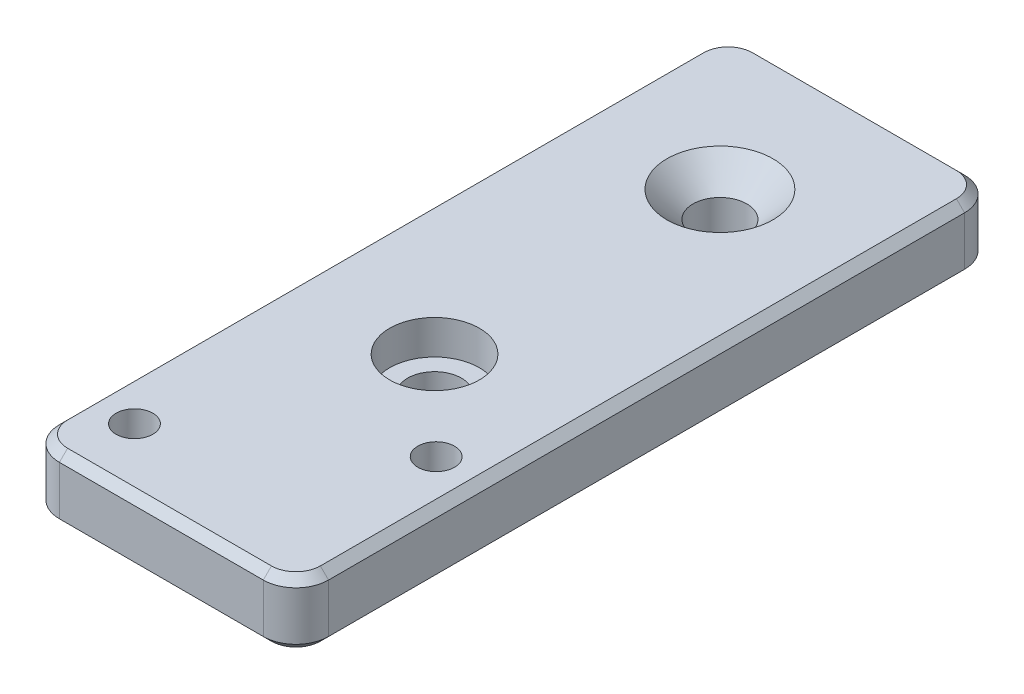
ISO-10303-21;
HEADER;
FILE_DESCRIPTION(('STEP AP214'),'2;1');
FILE_NAME('part.step','',(''),(''),'','','');
FILE_SCHEMA(('AUTOMOTIVE_DESIGN { 1 0 10303 214 1 1 1 1 }'));
ENDSEC;
DATA;
#1=APPLICATION_CONTEXT('core data for automotive mechanical design processes');
#2=APPLICATION_PROTOCOL_DEFINITION('international standard','automotive_design',2000,#1);
#3=PRODUCT_CONTEXT('',#1,'mechanical');
#4=PRODUCT('Part','Part','',(#3));
#5=PRODUCT_RELATED_PRODUCT_CATEGORY('part','',(#4));
#6=PRODUCT_DEFINITION_FORMATION('','',#4);
#7=PRODUCT_DEFINITION_CONTEXT('part definition',#1,'design');
#8=PRODUCT_DEFINITION('design','',#6,#7);
#9=PRODUCT_DEFINITION_SHAPE('','',#8);
#10=(LENGTH_UNIT() NAMED_UNIT(*) SI_UNIT(.MILLI.,.METRE.));
#11=(NAMED_UNIT(*) PLANE_ANGLE_UNIT() SI_UNIT($,.RADIAN.));
#12=(NAMED_UNIT(*) SI_UNIT($,.STERADIAN.) SOLID_ANGLE_UNIT());
#13=UNCERTAINTY_MEASURE_WITH_UNIT(LENGTH_MEASURE(1.E-05),#10,'distance_accuracy_value','');
#14=(GEOMETRIC_REPRESENTATION_CONTEXT(3) GLOBAL_UNCERTAINTY_ASSIGNED_CONTEXT((#13)) GLOBAL_UNIT_ASSIGNED_CONTEXT((#10,
#11,#12)) REPRESENTATION_CONTEXT('',''));
#15=CARTESIAN_POINT('',(0.,0.,0.));
#16=DIRECTION('',(0.,0.,1.));
#17=DIRECTION('',(1.,0.,0.));
#18=AXIS2_PLACEMENT_3D('',#15,#16,#17);
#19=CARTESIAN_POINT('',(-11.,0.,35.3));
#20=DIRECTION('',(0.,1.,0.));
#21=DIRECTION('',(0.,0.,1.));
#22=AXIS2_PLACEMENT_3D('',#19,#20,#21);
#23=CYLINDRICAL_SURFACE('',#22,2.25);
#24=CARTESIAN_POINT('',(-11.,8.,35.3));
#25=DIRECTION('',(0.,1.,0.));
#26=DIRECTION('',(0.,0.,1.));
#27=AXIS2_PLACEMENT_3D('',#24,#25,#26);
#28=CIRCLE('',#27,2.25);
#29=CARTESIAN_POINT('',(-11.,8.,37.55));
#30=VERTEX_POINT('',#29);
#31=EDGE_CURVE('E320',#30,#30,#28,.T.);
#32=ORIENTED_EDGE('',*,*,#31,.T.);
#33=EDGE_LOOP('',(#32));
#34=FACE_BOUND('',#33,.T.);
#35=CARTESIAN_POINT('',(-11.,4.4,35.3));
#36=DIRECTION('',(0.,-1.,0.));
#37=DIRECTION('',(0.,0.,-1.));
#38=AXIS2_PLACEMENT_3D('',#35,#36,#37);
#39=CIRCLE('',#38,2.25);
#40=CARTESIAN_POINT('',(-11.,4.4,33.05));
#41=VERTEX_POINT('',#40);
#42=EDGE_CURVE('E40',#41,#41,#39,.F.);
#43=ORIENTED_EDGE('',*,*,#42,.F.);
#44=EDGE_LOOP('',(#43));
#45=FACE_BOUND('',#44,.T.);
#46=ADVANCED_FACE('F36',(#34,#45),#23,.F.);
#47=CARTESIAN_POINT('',(11.,0.,20.3));
#48=DIRECTION('',(0.,1.,0.));
#49=DIRECTION('',(0.,0.,1.));
#50=AXIS2_PLACEMENT_3D('',#47,#48,#49);
#51=CYLINDRICAL_SURFACE('',#50,2.25);
#52=CARTESIAN_POINT('',(11.,8.,20.3));
#53=DIRECTION('',(0.,1.,0.));
#54=DIRECTION('',(0.,0.,1.));
#55=AXIS2_PLACEMENT_3D('',#52,#53,#54);
#56=CIRCLE('',#55,2.25);
#57=CARTESIAN_POINT('',(11.,8.,22.55));
#58=VERTEX_POINT('',#57);
#59=EDGE_CURVE('E366',#58,#58,#56,.T.);
#60=ORIENTED_EDGE('',*,*,#59,.T.);
#61=EDGE_LOOP('',(#60));
#62=FACE_BOUND('',#61,.T.);
#63=CARTESIAN_POINT('',(11.,4.4,20.3));
#64=DIRECTION('',(0.,-1.,0.));
#65=DIRECTION('',(0.,0.,-1.));
#66=AXIS2_PLACEMENT_3D('',#63,#64,#65);
#67=CIRCLE('',#66,2.25);
#68=CARTESIAN_POINT('',(11.,4.4,18.05));
#69=VERTEX_POINT('',#68);
#70=EDGE_CURVE('E324',#69,#69,#67,.F.);
#71=ORIENTED_EDGE('',*,*,#70,.F.);
#72=EDGE_LOOP('',(#71));
#73=FACE_BOUND('',#72,.T.);
#74=ADVANCED_FACE('F480',(#62,#73),#51,.F.);
#75=CARTESIAN_POINT('',(0.,0.,9.50000000000002));
#76=DIRECTION('',(0.,1.,0.));
#77=DIRECTION('',(0.,0.,1.));
#78=AXIS2_PLACEMENT_3D('',#75,#76,#77);
#79=CYLINDRICAL_SURFACE('',#78,3.3);
#80=CARTESIAN_POINT('',(0.,0.,9.50000000000002));
#81=DIRECTION('',(0.,1.,0.));
#82=DIRECTION('',(0.,0.,1.));
#83=AXIS2_PLACEMENT_3D('',#80,#81,#82);
#84=CIRCLE('',#83,3.3);
#85=CARTESIAN_POINT('',(0.,0.,12.8));
#86=VERTEX_POINT('',#85);
#87=EDGE_CURVE('E362',#86,#86,#84,.T.);
#88=ORIENTED_EDGE('',*,*,#87,.F.);
#89=EDGE_LOOP('',(#88));
#90=FACE_BOUND('',#89,.T.);
#91=CARTESIAN_POINT('',(0.,3.8,9.50000000000002));
#92=DIRECTION('',(0.,1.,0.));
#93=DIRECTION('',(0.,0.,1.));
#94=AXIS2_PLACEMENT_3D('',#91,#92,#93);
#95=CIRCLE('',#94,3.3);
#96=CARTESIAN_POINT('',(0.,3.8,12.8));
#97=VERTEX_POINT('',#96);
#98=EDGE_CURVE('E316',#97,#97,#95,.F.);
#99=ORIENTED_EDGE('',*,*,#98,.F.);
#100=EDGE_LOOP('',(#99));
#101=FACE_BOUND('',#100,.T.);
#102=ADVANCED_FACE('F486',(#90,#101),#79,.F.);
#103=CARTESIAN_POINT('',(16.5,8.,-43.));
#104=DIRECTION('',(-1.,0.,0.));
#105=DIRECTION('',(0.,0.,1.));
#106=AXIS2_PLACEMENT_3D('',#103,#104,#105);
#107=PLANE('',#106);
#108=DIRECTION('',(0.,-1.,0.));
#109=VECTOR('',#108,1.);
#110=CARTESIAN_POINT('',(16.5,8.,-39.));
#111=LINE('',#110,#109);
#112=CARTESIAN_POINT('',(16.5,0.999999999999987,-39.));
#113=VERTEX_POINT('',#112);
#114=CARTESIAN_POINT('',(16.5,6.99999999999999,-39.));
#115=VERTEX_POINT('',#114);
#116=EDGE_CURVE('E392',#113,#115,#111,.F.);
#117=ORIENTED_EDGE('',*,*,#116,.T.);
#118=DIRECTION('',(0.,0.,1.));
#119=VECTOR('',#118,1.);
#120=CARTESIAN_POINT('',(16.5,6.99999999999999,39.));
#121=LINE('',#120,#119);
#122=CARTESIAN_POINT('',(16.5,6.99999999999999,39.));
#123=VERTEX_POINT('',#122);
#124=EDGE_CURVE('E161',#115,#123,#121,.T.);
#125=ORIENTED_EDGE('',*,*,#124,.T.);
#126=DIRECTION('',(0.,-1.,0.));
#127=VECTOR('',#126,1.);
#128=CARTESIAN_POINT('',(16.5,8.,39.));
#129=LINE('',#128,#127);
#130=CARTESIAN_POINT('',(16.5,0.999999999999987,39.));
#131=VERTEX_POINT('',#130);
#132=EDGE_CURVE('E388',#123,#131,#129,.T.);
#133=ORIENTED_EDGE('',*,*,#132,.T.);
#134=DIRECTION('',(0.,0.,-1.));
#135=VECTOR('',#134,1.);
#136=CARTESIAN_POINT('',(16.5,0.999999999999987,-43.));
#137=LINE('',#136,#135);
#138=EDGE_CURVE('E184',#131,#113,#137,.T.);
#139=ORIENTED_EDGE('',*,*,#138,.T.);
#140=EDGE_LOOP('',(#117,#125,#133,#139));
#141=FACE_BOUND('',#140,.T.);
#142=ADVANCED_FACE('F429',(#141),#107,.F.);
#143=CARTESIAN_POINT('',(-16.5,8.,-43.));
#144=DIRECTION('',(0.,0.,1.));
#145=DIRECTION('',(1.,0.,0.));
#146=AXIS2_PLACEMENT_3D('',#143,#144,#145);
#147=PLANE('',#146);
#148=DIRECTION('',(0.,-1.,0.));
#149=VECTOR('',#148,1.);
#150=CARTESIAN_POINT('',(-12.5,8.,-43.));
#151=LINE('',#150,#149);
#152=CARTESIAN_POINT('',(-12.5,0.999999999999987,-43.));
#153=VERTEX_POINT('',#152);
#154=CARTESIAN_POINT('',(-12.5,6.99999999999999,-43.));
#155=VERTEX_POINT('',#154);
#156=EDGE_CURVE('E384',#153,#155,#151,.F.);
#157=ORIENTED_EDGE('',*,*,#156,.T.);
#158=DIRECTION('',(1.,0.,0.));
#159=VECTOR('',#158,1.);
#160=CARTESIAN_POINT('',(12.5,6.99999999999999,-43.));
#161=LINE('',#160,#159);
#162=CARTESIAN_POINT('',(12.5,6.99999999999999,-43.));
#163=VERTEX_POINT('',#162);
#164=EDGE_CURVE('E230',#155,#163,#161,.T.);
#165=ORIENTED_EDGE('',*,*,#164,.T.);
#166=DIRECTION('',(0.,-1.,0.));
#167=VECTOR('',#166,1.);
#168=CARTESIAN_POINT('',(12.5,8.,-43.));
#169=LINE('',#168,#167);
#170=CARTESIAN_POINT('',(12.5,0.999999999999987,-43.));
#171=VERTEX_POINT('',#170);
#172=EDGE_CURVE('E380',#163,#171,#169,.T.);
#173=ORIENTED_EDGE('',*,*,#172,.T.);
#174=DIRECTION('',(-1.,0.,0.));
#175=VECTOR('',#174,1.);
#176=CARTESIAN_POINT('',(-16.5,0.999999999999987,-43.));
#177=LINE('',#176,#175);
#178=EDGE_CURVE('E227',#171,#153,#177,.T.);
#179=ORIENTED_EDGE('',*,*,#178,.T.);
#180=EDGE_LOOP('',(#157,#165,#173,#179));
#181=FACE_BOUND('',#180,.T.);
#182=ADVANCED_FACE('F503',(#181),#147,.F.);
#183=CARTESIAN_POINT('',(-16.5,8.,-43.));
#184=DIRECTION('',(1.,0.,0.));
#185=DIRECTION('',(0.,0.,-1.));
#186=AXIS2_PLACEMENT_3D('',#183,#184,#185);
#187=PLANE('',#186);
#188=DIRECTION('',(0.,-1.,0.));
#189=VECTOR('',#188,1.);
#190=CARTESIAN_POINT('',(-16.5,8.,39.));
#191=LINE('',#190,#189);
#192=CARTESIAN_POINT('',(-16.5,0.999999999999987,39.));
#193=VERTEX_POINT('',#192);
#194=CARTESIAN_POINT('',(-16.5,6.99999999999999,39.));
#195=VERTEX_POINT('',#194);
#196=EDGE_CURVE('E286',#193,#195,#191,.F.);
#197=ORIENTED_EDGE('',*,*,#196,.T.);
#198=DIRECTION('',(0.,0.,-1.));
#199=VECTOR('',#198,1.);
#200=CARTESIAN_POINT('',(-16.5,6.99999999999999,-39.));
#201=LINE('',#200,#199);
#202=CARTESIAN_POINT('',(-16.5,6.99999999999999,-39.));
#203=VERTEX_POINT('',#202);
#204=EDGE_CURVE('E218',#195,#203,#201,.T.);
#205=ORIENTED_EDGE('',*,*,#204,.T.);
#206=DIRECTION('',(0.,-1.,0.));
#207=VECTOR('',#206,1.);
#208=CARTESIAN_POINT('',(-16.5,8.,-39.));
#209=LINE('',#208,#207);
#210=CARTESIAN_POINT('',(-16.5,0.999999999999987,-39.));
#211=VERTEX_POINT('',#210);
#212=EDGE_CURVE('E376',#203,#211,#209,.T.);
#213=ORIENTED_EDGE('',*,*,#212,.T.);
#214=DIRECTION('',(0.,0.,1.));
#215=VECTOR('',#214,1.);
#216=CARTESIAN_POINT('',(-16.5,0.999999999999987,-43.));
#217=LINE('',#216,#215);
#218=EDGE_CURVE('E215',#211,#193,#217,.T.);
#219=ORIENTED_EDGE('',*,*,#218,.T.);
#220=EDGE_LOOP('',(#197,#205,#213,#219));
#221=FACE_BOUND('',#220,.T.);
#222=ADVANCED_FACE('F459',(#221),#187,.F.);
#223=CARTESIAN_POINT('',(-16.5,8.,43.));
#224=DIRECTION('',(0.,0.,-1.));
#225=DIRECTION('',(-1.,0.,0.));
#226=AXIS2_PLACEMENT_3D('',#223,#224,#225);
#227=PLANE('',#226);
#228=DIRECTION('',(0.,-1.,0.));
#229=VECTOR('',#228,1.);
#230=CARTESIAN_POINT('',(12.5,8.,43.));
#231=LINE('',#230,#229);
#232=CARTESIAN_POINT('',(12.5,0.999999999999987,43.));
#233=VERTEX_POINT('',#232);
#234=CARTESIAN_POINT('',(12.5,6.99999999999999,43.));
#235=VERTEX_POINT('',#234);
#236=EDGE_CURVE('E396',#233,#235,#231,.F.);
#237=ORIENTED_EDGE('',*,*,#236,.T.);
#238=DIRECTION('',(-1.,0.,0.));
#239=VECTOR('',#238,1.);
#240=CARTESIAN_POINT('',(-12.5,6.99999999999999,43.));
#241=LINE('',#240,#239);
#242=CARTESIAN_POINT('',(-12.5,6.99999999999999,43.));
#243=VERTEX_POINT('',#242);
#244=EDGE_CURVE('E206',#235,#243,#241,.T.);
#245=ORIENTED_EDGE('',*,*,#244,.T.);
#246=DIRECTION('',(0.,-1.,0.));
#247=VECTOR('',#246,1.);
#248=CARTESIAN_POINT('',(-12.5,8.,43.));
#249=LINE('',#248,#247);
#250=CARTESIAN_POINT('',(-12.5,0.999999999999987,43.));
#251=VERTEX_POINT('',#250);
#252=EDGE_CURVE('E177',#243,#251,#249,.T.);
#253=ORIENTED_EDGE('',*,*,#252,.T.);
#254=DIRECTION('',(1.,0.,0.));
#255=VECTOR('',#254,1.);
#256=CARTESIAN_POINT('',(-16.5,0.999999999999987,43.));
#257=LINE('',#256,#255);
#258=EDGE_CURVE('E202',#251,#233,#257,.T.);
#259=ORIENTED_EDGE('',*,*,#258,.T.);
#260=EDGE_LOOP('',(#237,#245,#253,#259));
#261=FACE_BOUND('',#260,.T.);
#262=ADVANCED_FACE('F439',(#261),#227,.F.);
#263=CARTESIAN_POINT('',(0.,8.,0.));
#264=DIRECTION('',(0.,1.,0.));
#265=DIRECTION('',(0.,0.,1.));
#266=AXIS2_PLACEMENT_3D('',#263,#264,#265);
#267=PLANE('',#266);
#268=CARTESIAN_POINT('',(0.,8.,-25.5));
#269=DIRECTION('',(0.,1.,0.));
#270=DIRECTION('',(0.,0.,1.));
#271=AXIS2_PLACEMENT_3D('',#268,#269,#270);
#272=CIRCLE('',#271,6.49999999999998);
#273=CARTESIAN_POINT('',(0.,8.,-19.));
#274=VERTEX_POINT('',#273);
#275=EDGE_CURVE('E11',#274,#274,#272,.F.);
#276=ORIENTED_EDGE('',*,*,#275,.T.);
#277=EDGE_LOOP('',(#276));
#278=FACE_BOUND('',#277,.T.);
#279=CARTESIAN_POINT('',(0.,8.,9.50000000000002));
#280=DIRECTION('',(0.,1.,0.));
#281=DIRECTION('',(0.,0.,1.));
#282=AXIS2_PLACEMENT_3D('',#279,#280,#281);
#283=CIRCLE('',#282,5.5);
#284=CARTESIAN_POINT('',(0.,8.,15.));
#285=VERTEX_POINT('',#284);
#286=EDGE_CURVE('E334',#285,#285,#283,.T.);
#287=ORIENTED_EDGE('',*,*,#286,.F.);
#288=EDGE_LOOP('',(#287));
#289=FACE_BOUND('',#288,.T.);
#290=ORIENTED_EDGE('',*,*,#59,.F.);
#291=EDGE_LOOP('',(#290));
#292=FACE_BOUND('',#291,.T.);
#293=ORIENTED_EDGE('',*,*,#31,.F.);
#294=EDGE_LOOP('',(#293));
#295=FACE_BOUND('',#294,.T.);
#296=CARTESIAN_POINT('',(12.5,8.,39.));
#297=DIRECTION('',(0.,1.,0.));
#298=DIRECTION('',(0.,0.,1.));
#299=AXIS2_PLACEMENT_3D('',#296,#297,#298);
#300=CIRCLE('',#299,2.99999999999999);
#301=CARTESIAN_POINT('',(12.5,8.,42.));
#302=VERTEX_POINT('',#301);
#303=CARTESIAN_POINT('',(15.5,8.,39.));
#304=VERTEX_POINT('',#303);
#305=EDGE_CURVE('E181',#302,#304,#300,.T.);
#306=ORIENTED_EDGE('',*,*,#305,.T.);
#307=DIRECTION('',(0.,0.,-1.));
#308=VECTOR('',#307,1.);
#309=CARTESIAN_POINT('',(15.5,8.,-39.));
#310=LINE('',#309,#308);
#311=CARTESIAN_POINT('',(15.5,8.,-39.));
#312=VERTEX_POINT('',#311);
#313=EDGE_CURVE('E159',#304,#312,#310,.T.);
#314=ORIENTED_EDGE('',*,*,#313,.T.);
#315=CARTESIAN_POINT('',(12.5,8.,-39.));
#316=DIRECTION('',(0.,1.,0.));
#317=DIRECTION('',(0.,0.,1.));
#318=AXIS2_PLACEMENT_3D('',#315,#316,#317);
#319=CIRCLE('',#318,2.99999999999999);
#320=CARTESIAN_POINT('',(12.5,8.,-42.));
#321=VERTEX_POINT('',#320);
#322=EDGE_CURVE('E169',#312,#321,#319,.T.);
#323=ORIENTED_EDGE('',*,*,#322,.T.);
#324=DIRECTION('',(-1.,0.,0.));
#325=VECTOR('',#324,1.);
#326=CARTESIAN_POINT('',(-12.5,8.,-42.));
#327=LINE('',#326,#325);
#328=CARTESIAN_POINT('',(-12.5,8.,-42.));
#329=VERTEX_POINT('',#328);
#330=EDGE_CURVE('E176',#321,#329,#327,.T.);
#331=ORIENTED_EDGE('',*,*,#330,.T.);
#332=CARTESIAN_POINT('',(-12.5,8.,-39.));
#333=DIRECTION('',(0.,1.,0.));
#334=DIRECTION('',(0.,0.,1.));
#335=AXIS2_PLACEMENT_3D('',#332,#333,#334);
#336=CIRCLE('',#335,2.99999999999999);
#337=CARTESIAN_POINT('',(-15.5,8.,-39.));
#338=VERTEX_POINT('',#337);
#339=EDGE_CURVE('E405',#329,#338,#336,.T.);
#340=ORIENTED_EDGE('',*,*,#339,.T.);
#341=DIRECTION('',(0.,0.,1.));
#342=VECTOR('',#341,1.);
#343=CARTESIAN_POINT('',(-15.5,8.,39.));
#344=LINE('',#343,#342);
#345=CARTESIAN_POINT('',(-15.5,8.,39.));
#346=VERTEX_POINT('',#345);
#347=EDGE_CURVE('E408',#338,#346,#344,.T.);
#348=ORIENTED_EDGE('',*,*,#347,.T.);
#349=CARTESIAN_POINT('',(-12.5,8.,39.));
#350=DIRECTION('',(0.,1.,0.));
#351=DIRECTION('',(0.,0.,1.));
#352=AXIS2_PLACEMENT_3D('',#349,#350,#351);
#353=CIRCLE('',#352,2.99999999999999);
#354=CARTESIAN_POINT('',(-12.5,8.,42.));
#355=VERTEX_POINT('',#354);
#356=EDGE_CURVE('E411',#346,#355,#353,.T.);
#357=ORIENTED_EDGE('',*,*,#356,.T.);
#358=DIRECTION('',(1.,0.,0.));
#359=VECTOR('',#358,1.);
#360=CARTESIAN_POINT('',(12.5,8.,42.));
#361=LINE('',#360,#359);
#362=EDGE_CURVE('E190',#355,#302,#361,.T.);
#363=ORIENTED_EDGE('',*,*,#362,.T.);
#364=EDGE_LOOP('',(#306,#314,#323,#331,#340,#348,#357,#363));
#365=FACE_BOUND('',#364,.T.);
#366=ADVANCED_FACE('F179',(#278,#289,#292,#295,#365),#267,.T.);
#367=CARTESIAN_POINT('',(0.,0.,0.));
#368=DIRECTION('',(0.,1.,0.));
#369=DIRECTION('',(0.,0.,1.));
#370=AXIS2_PLACEMENT_3D('',#367,#368,#369);
#371=PLANE('',#370);
#372=CARTESIAN_POINT('',(11.,0.,20.3));
#373=DIRECTION('',(0.,-1.,0.));
#374=DIRECTION('',(0.,0.,-1.));
#375=AXIS2_PLACEMENT_3D('',#372,#373,#374);
#376=CIRCLE('',#375,4.);
#377=CARTESIAN_POINT('',(11.,0.,16.3));
#378=VERTEX_POINT('',#377);
#379=EDGE_CURVE('E336',#378,#378,#376,.T.);
#380=ORIENTED_EDGE('',*,*,#379,.F.);
#381=EDGE_LOOP('',(#380));
#382=FACE_BOUND('',#381,.T.);
#383=CARTESIAN_POINT('',(-11.,0.,35.3));
#384=DIRECTION('',(0.,-1.,0.));
#385=DIRECTION('',(0.,0.,-1.));
#386=AXIS2_PLACEMENT_3D('',#383,#384,#385);
#387=CIRCLE('',#386,4.);
#388=CARTESIAN_POINT('',(-11.,0.,31.3));
#389=VERTEX_POINT('',#388);
#390=EDGE_CURVE('E349',#389,#389,#387,.T.);
#391=ORIENTED_EDGE('',*,*,#390,.F.);
#392=EDGE_LOOP('',(#391));
#393=FACE_BOUND('',#392,.T.);
#394=CARTESIAN_POINT('',(0.,0.,-25.5));
#395=DIRECTION('',(0.,1.,0.));
#396=DIRECTION('',(0.,0.,1.));
#397=AXIS2_PLACEMENT_3D('',#394,#395,#396);
#398=CIRCLE('',#397,3.3);
#399=CARTESIAN_POINT('',(0.,0.,-22.2));
#400=VERTEX_POINT('',#399);
#401=EDGE_CURVE('E290',#400,#400,#398,.T.);
#402=ORIENTED_EDGE('',*,*,#401,.T.);
#403=EDGE_LOOP('',(#402));
#404=FACE_BOUND('',#403,.T.);
#405=ORIENTED_EDGE('',*,*,#87,.T.);
#406=EDGE_LOOP('',(#405));
#407=FACE_BOUND('',#406,.T.);
#408=CARTESIAN_POINT('',(12.5,0.,39.));
#409=DIRECTION('',(0.,1.,0.));
#410=DIRECTION('',(0.,0.,1.));
#411=AXIS2_PLACEMENT_3D('',#408,#409,#410);
#412=CIRCLE('',#411,3.);
#413=CARTESIAN_POINT('',(15.5,0.,39.));
#414=VERTEX_POINT('',#413);
#415=CARTESIAN_POINT('',(12.5,0.,42.));
#416=VERTEX_POINT('',#415);
#417=EDGE_CURVE('E62',#414,#416,#412,.F.);
#418=ORIENTED_EDGE('',*,*,#417,.T.);
#419=DIRECTION('',(-1.,0.,0.));
#420=VECTOR('',#419,1.);
#421=CARTESIAN_POINT('',(0.,0.,42.));
#422=LINE('',#421,#420);
#423=CARTESIAN_POINT('',(-12.5,0.,42.));
#424=VERTEX_POINT('',#423);
#425=EDGE_CURVE('E259',#416,#424,#422,.T.);
#426=ORIENTED_EDGE('',*,*,#425,.T.);
#427=CARTESIAN_POINT('',(-12.5,0.,39.));
#428=DIRECTION('',(0.,1.,0.));
#429=DIRECTION('',(0.,0.,1.));
#430=AXIS2_PLACEMENT_3D('',#427,#428,#429);
#431=CIRCLE('',#430,3.);
#432=CARTESIAN_POINT('',(-15.5,0.,39.));
#433=VERTEX_POINT('',#432);
#434=EDGE_CURVE('E256',#424,#433,#431,.F.);
#435=ORIENTED_EDGE('',*,*,#434,.T.);
#436=DIRECTION('',(0.,0.,-1.));
#437=VECTOR('',#436,1.);
#438=CARTESIAN_POINT('',(-15.5,0.,0.));
#439=LINE('',#438,#437);
#440=CARTESIAN_POINT('',(-15.5,0.,-39.));
#441=VERTEX_POINT('',#440);
#442=EDGE_CURVE('E245',#433,#441,#439,.T.);
#443=ORIENTED_EDGE('',*,*,#442,.T.);
#444=CARTESIAN_POINT('',(-12.5,0.,-39.));
#445=DIRECTION('',(0.,1.,0.));
#446=DIRECTION('',(0.,0.,1.));
#447=AXIS2_PLACEMENT_3D('',#444,#445,#446);
#448=CIRCLE('',#447,3.);
#449=CARTESIAN_POINT('',(-12.5,0.,-42.));
#450=VERTEX_POINT('',#449);
#451=EDGE_CURVE('E242',#441,#450,#448,.F.);
#452=ORIENTED_EDGE('',*,*,#451,.T.);
#453=DIRECTION('',(1.,0.,0.));
#454=VECTOR('',#453,1.);
#455=CARTESIAN_POINT('',(0.,0.,-42.));
#456=LINE('',#455,#454);
#457=CARTESIAN_POINT('',(12.5,0.,-42.));
#458=VERTEX_POINT('',#457);
#459=EDGE_CURVE('E239',#450,#458,#456,.T.);
#460=ORIENTED_EDGE('',*,*,#459,.T.);
#461=CARTESIAN_POINT('',(12.5,0.,-39.));
#462=DIRECTION('',(0.,1.,0.));
#463=DIRECTION('',(0.,0.,1.));
#464=AXIS2_PLACEMENT_3D('',#461,#462,#463);
#465=CIRCLE('',#464,3.);
#466=CARTESIAN_POINT('',(15.5,0.,-39.));
#467=VERTEX_POINT('',#466);
#468=EDGE_CURVE('E248',#458,#467,#465,.F.);
#469=ORIENTED_EDGE('',*,*,#468,.T.);
#470=DIRECTION('',(0.,0.,1.));
#471=VECTOR('',#470,1.);
#472=CARTESIAN_POINT('',(15.5,0.,0.));
#473=LINE('',#472,#471);
#474=EDGE_CURVE('E251',#467,#414,#473,.T.);
#475=ORIENTED_EDGE('',*,*,#474,.T.);
#476=EDGE_LOOP('',(#418,#426,#435,#443,#452,#460,#469,#475));
#477=FACE_BOUND('',#476,.T.);
#478=ADVANCED_FACE('F442',(#382,#393,#404,#407,#477),#371,.F.);
#479=CARTESIAN_POINT('',(-12.5,8.,-39.));
#480=DIRECTION('',(0.,-1.,0.));
#481=DIRECTION('',(0.,0.,-1.));
#482=AXIS2_PLACEMENT_3D('',#479,#480,#481);
#483=CYLINDRICAL_SURFACE('',#482,4.);
#484=ORIENTED_EDGE('',*,*,#212,.F.);
#485=CARTESIAN_POINT('',(-12.5,6.99999999999999,-39.));
#486=DIRECTION('',(0.,1.,0.));
#487=DIRECTION('',(0.,0.,1.));
#488=AXIS2_PLACEMENT_3D('',#485,#486,#487);
#489=CIRCLE('',#488,4.);
#490=EDGE_CURVE('E224',#203,#155,#489,.F.);
#491=ORIENTED_EDGE('',*,*,#490,.T.);
#492=ORIENTED_EDGE('',*,*,#156,.F.);
#493=CARTESIAN_POINT('',(-12.5,0.999999999999987,-39.));
#494=DIRECTION('',(0.,1.,0.));
#495=DIRECTION('',(0.,0.,1.));
#496=AXIS2_PLACEMENT_3D('',#493,#494,#495);
#497=CIRCLE('',#496,4.);
#498=EDGE_CURVE('E221',#153,#211,#497,.T.);
#499=ORIENTED_EDGE('',*,*,#498,.T.);
#500=EDGE_LOOP('',(#484,#491,#492,#499));
#501=FACE_BOUND('',#500,.T.);
#502=ADVANCED_FACE('F497',(#501),#483,.T.);
#503=CARTESIAN_POINT('',(12.5,8.,-39.));
#504=DIRECTION('',(0.,-1.,0.));
#505=DIRECTION('',(0.,0.,-1.));
#506=AXIS2_PLACEMENT_3D('',#503,#504,#505);
#507=CYLINDRICAL_SURFACE('',#506,4.);
#508=ORIENTED_EDGE('',*,*,#172,.F.);
#509=CARTESIAN_POINT('',(12.5,6.99999999999999,-39.));
#510=DIRECTION('',(0.,1.,0.));
#511=DIRECTION('',(0.,0.,1.));
#512=AXIS2_PLACEMENT_3D('',#509,#510,#511);
#513=CIRCLE('',#512,4.);
#514=EDGE_CURVE('E236',#163,#115,#513,.F.);
#515=ORIENTED_EDGE('',*,*,#514,.T.);
#516=ORIENTED_EDGE('',*,*,#116,.F.);
#517=CARTESIAN_POINT('',(12.5,0.999999999999987,-39.));
#518=DIRECTION('',(0.,1.,0.));
#519=DIRECTION('',(0.,0.,1.));
#520=AXIS2_PLACEMENT_3D('',#517,#518,#519);
#521=CIRCLE('',#520,4.);
#522=EDGE_CURVE('E233',#113,#171,#521,.T.);
#523=ORIENTED_EDGE('',*,*,#522,.T.);
#524=EDGE_LOOP('',(#508,#515,#516,#523));
#525=FACE_BOUND('',#524,.T.);
#526=ADVANCED_FACE('F511',(#525),#507,.T.);
#527=CARTESIAN_POINT('',(-12.5,8.,39.));
#528=DIRECTION('',(0.,-1.,0.));
#529=DIRECTION('',(0.,0.,-1.));
#530=AXIS2_PLACEMENT_3D('',#527,#528,#529);
#531=CYLINDRICAL_SURFACE('',#530,4.);
#532=ORIENTED_EDGE('',*,*,#252,.F.);
#533=CARTESIAN_POINT('',(-12.5,6.99999999999999,39.));
#534=DIRECTION('',(0.,1.,0.));
#535=DIRECTION('',(0.,0.,1.));
#536=AXIS2_PLACEMENT_3D('',#533,#534,#535);
#537=CIRCLE('',#536,4.);
#538=EDGE_CURVE('E212',#243,#195,#537,.F.);
#539=ORIENTED_EDGE('',*,*,#538,.T.);
#540=ORIENTED_EDGE('',*,*,#196,.F.);
#541=CARTESIAN_POINT('',(-12.5,0.999999999999987,39.));
#542=DIRECTION('',(0.,1.,0.));
#543=DIRECTION('',(0.,0.,1.));
#544=AXIS2_PLACEMENT_3D('',#541,#542,#543);
#545=CIRCLE('',#544,4.);
#546=EDGE_CURVE('E209',#193,#251,#545,.T.);
#547=ORIENTED_EDGE('',*,*,#546,.T.);
#548=EDGE_LOOP('',(#532,#539,#540,#547));
#549=FACE_BOUND('',#548,.T.);
#550=ADVANCED_FACE('F455',(#549),#531,.T.);
#551=CARTESIAN_POINT('',(12.5,8.,39.));
#552=DIRECTION('',(0.,-1.,0.));
#553=DIRECTION('',(0.,0.,-1.));
#554=AXIS2_PLACEMENT_3D('',#551,#552,#553);
#555=CYLINDRICAL_SURFACE('',#554,4.);
#556=ORIENTED_EDGE('',*,*,#132,.F.);
#557=CARTESIAN_POINT('',(12.5,6.99999999999999,39.));
#558=DIRECTION('',(0.,1.,0.));
#559=DIRECTION('',(0.,0.,1.));
#560=AXIS2_PLACEMENT_3D('',#557,#558,#559);
#561=CIRCLE('',#560,4.);
#562=EDGE_CURVE('E199',#123,#235,#561,.F.);
#563=ORIENTED_EDGE('',*,*,#562,.T.);
#564=ORIENTED_EDGE('',*,*,#236,.F.);
#565=CARTESIAN_POINT('',(12.5,0.999999999999987,39.));
#566=DIRECTION('',(0.,1.,0.));
#567=DIRECTION('',(0.,0.,1.));
#568=AXIS2_PLACEMENT_3D('',#565,#566,#567);
#569=CIRCLE('',#568,4.);
#570=EDGE_CURVE('E196',#233,#131,#569,.T.);
#571=ORIENTED_EDGE('',*,*,#570,.T.);
#572=EDGE_LOOP('',(#556,#563,#564,#571));
#573=FACE_BOUND('',#572,.T.);
#574=ADVANCED_FACE('F432',(#573),#555,.T.);
#575=CARTESIAN_POINT('',(-15.5,8.,0.));
#576=DIRECTION('',(-0.707106781186547,0.707106781186548,0.));
#577=DIRECTION('',(0.,0.,-1.));
#578=AXIS2_PLACEMENT_3D('',#575,#576,#577);
#579=PLANE('',#578);
#580=DIRECTION('',(0.707106781186548,0.707106781186547,0.));
#581=VECTOR('',#580,1.);
#582=CARTESIAN_POINT('',(-16.5,6.99999999999999,-39.));
#583=LINE('',#582,#581);
#584=EDGE_CURVE('E278',#203,#338,#583,.T.);
#585=ORIENTED_EDGE('',*,*,#584,.F.);
#586=ORIENTED_EDGE('',*,*,#204,.F.);
#587=DIRECTION('',(-0.707106781186548,-0.707106781186547,0.));
#588=VECTOR('',#587,1.);
#589=CARTESIAN_POINT('',(-15.5,8.,39.));
#590=LINE('',#589,#588);
#591=EDGE_CURVE('E282',#346,#195,#590,.T.);
#592=ORIENTED_EDGE('',*,*,#591,.F.);
#593=ORIENTED_EDGE('',*,*,#347,.F.);
#594=EDGE_LOOP('',(#585,#586,#592,#593));
#595=FACE_BOUND('',#594,.T.);
#596=ADVANCED_FACE('F464',(#595),#579,.T.);
#597=CARTESIAN_POINT('',(-12.5,8.,39.));
#598=DIRECTION('',(0.,-1.,0.));
#599=DIRECTION('',(0.,0.,-1.));
#600=AXIS2_PLACEMENT_3D('',#597,#598,#599);
#601=CONICAL_SURFACE('',#600,2.99999999999999,0.785398163397449);
#602=ORIENTED_EDGE('',*,*,#591,.T.);
#603=ORIENTED_EDGE('',*,*,#538,.F.);
#604=DIRECTION('',(0.,-0.707106781186545,0.70710678118655));
#605=VECTOR('',#604,1.);
#606=CARTESIAN_POINT('',(-12.5,8.,42.));
#607=LINE('',#606,#605);
#608=EDGE_CURVE('E274',#355,#243,#607,.T.);
#609=ORIENTED_EDGE('',*,*,#608,.F.);
#610=ORIENTED_EDGE('',*,*,#356,.F.);
#611=EDGE_LOOP('',(#602,#603,#609,#610));
#612=FACE_BOUND('',#611,.T.);
#613=ADVANCED_FACE('F468',(#612),#601,.T.);
#614=CARTESIAN_POINT('',(-12.5,8.,-39.));
#615=DIRECTION('',(0.,-1.,0.));
#616=DIRECTION('',(0.,0.,-1.));
#617=AXIS2_PLACEMENT_3D('',#614,#615,#616);
#618=CONICAL_SURFACE('',#617,2.99999999999999,0.78539816339745);
#619=ORIENTED_EDGE('',*,*,#584,.T.);
#620=ORIENTED_EDGE('',*,*,#339,.F.);
#621=DIRECTION('',(0.,0.707106781186545,0.70710678118655));
#622=VECTOR('',#621,1.);
#623=CARTESIAN_POINT('',(-12.5,6.99999999999999,-43.));
#624=LINE('',#623,#622);
#625=EDGE_CURVE('E270',#155,#329,#624,.T.);
#626=ORIENTED_EDGE('',*,*,#625,.F.);
#627=ORIENTED_EDGE('',*,*,#490,.F.);
#628=EDGE_LOOP('',(#619,#620,#626,#627));
#629=FACE_BOUND('',#628,.T.);
#630=ADVANCED_FACE('F470',(#629),#618,.T.);
#631=CARTESIAN_POINT('',(0.,8.,42.));
#632=DIRECTION('',(0.,0.707106781186547,0.707106781186548));
#633=DIRECTION('',(-1.,0.,0.));
#634=AXIS2_PLACEMENT_3D('',#631,#632,#633);
#635=PLANE('',#634);
#636=ORIENTED_EDGE('',*,*,#608,.T.);
#637=ORIENTED_EDGE('',*,*,#244,.F.);
#638=DIRECTION('',(0.,-0.707106781186548,0.707106781186547));
#639=VECTOR('',#638,1.);
#640=CARTESIAN_POINT('',(12.5,8.,42.));
#641=LINE('',#640,#639);
#642=EDGE_CURVE('E266',#302,#235,#641,.T.);
#643=ORIENTED_EDGE('',*,*,#642,.F.);
#644=ORIENTED_EDGE('',*,*,#362,.F.);
#645=EDGE_LOOP('',(#636,#637,#643,#644));
#646=FACE_BOUND('',#645,.T.);
#647=ADVANCED_FACE('F421',(#646),#635,.T.);
#648=CARTESIAN_POINT('',(0.,8.,-42.));
#649=DIRECTION('',(0.,0.707106781186547,-0.707106781186548));
#650=DIRECTION('',(1.,0.,0.));
#651=AXIS2_PLACEMENT_3D('',#648,#649,#650);
#652=PLANE('',#651);
#653=ORIENTED_EDGE('',*,*,#625,.T.);
#654=ORIENTED_EDGE('',*,*,#330,.F.);
#655=DIRECTION('',(0.,0.707106781186548,0.707106781186547));
#656=VECTOR('',#655,1.);
#657=CARTESIAN_POINT('',(12.5,6.99999999999999,-43.));
#658=LINE('',#657,#656);
#659=EDGE_CURVE('E172',#163,#321,#658,.T.);
#660=ORIENTED_EDGE('',*,*,#659,.F.);
#661=ORIENTED_EDGE('',*,*,#164,.F.);
#662=EDGE_LOOP('',(#653,#654,#660,#661));
#663=FACE_BOUND('',#662,.T.);
#664=ADVANCED_FACE('F527',(#663),#652,.T.);
#665=CARTESIAN_POINT('',(12.5,8.,39.));
#666=DIRECTION('',(0.,-1.,0.));
#667=DIRECTION('',(0.,0.,-1.));
#668=AXIS2_PLACEMENT_3D('',#665,#666,#667);
#669=CONICAL_SURFACE('',#668,2.99999999999999,0.78539816339745);
#670=ORIENTED_EDGE('',*,*,#642,.T.);
#671=ORIENTED_EDGE('',*,*,#562,.F.);
#672=DIRECTION('',(0.707106781186548,-0.707106781186547,0.));
#673=VECTOR('',#672,1.);
#674=CARTESIAN_POINT('',(15.5,8.,39.));
#675=LINE('',#674,#673);
#676=EDGE_CURVE('E165',#304,#123,#675,.T.);
#677=ORIENTED_EDGE('',*,*,#676,.F.);
#678=ORIENTED_EDGE('',*,*,#305,.F.);
#679=EDGE_LOOP('',(#670,#671,#677,#678));
#680=FACE_BOUND('',#679,.T.);
#681=ADVANCED_FACE('F424',(#680),#669,.T.);
#682=CARTESIAN_POINT('',(12.5,8.,-39.));
#683=DIRECTION('',(0.,-1.,0.));
#684=DIRECTION('',(0.,0.,-1.));
#685=AXIS2_PLACEMENT_3D('',#682,#683,#684);
#686=CONICAL_SURFACE('',#685,2.99999999999999,0.785398163397449);
#687=ORIENTED_EDGE('',*,*,#659,.T.);
#688=ORIENTED_EDGE('',*,*,#322,.F.);
#689=DIRECTION('',(-0.707106781186548,0.707106781186547,0.));
#690=VECTOR('',#689,1.);
#691=CARTESIAN_POINT('',(16.5,6.99999999999999,-39.));
#692=LINE('',#691,#690);
#693=EDGE_CURVE('E155',#115,#312,#692,.T.);
#694=ORIENTED_EDGE('',*,*,#693,.F.);
#695=ORIENTED_EDGE('',*,*,#514,.F.);
#696=EDGE_LOOP('',(#687,#688,#694,#695));
#697=FACE_BOUND('',#696,.T.);
#698=ADVANCED_FACE('F170',(#697),#686,.T.);
#699=CARTESIAN_POINT('',(15.5,8.,0.));
#700=DIRECTION('',(0.707106781186547,0.707106781186548,0.));
#701=DIRECTION('',(0.,0.,1.));
#702=AXIS2_PLACEMENT_3D('',#699,#700,#701);
#703=PLANE('',#702);
#704=ORIENTED_EDGE('',*,*,#676,.T.);
#705=ORIENTED_EDGE('',*,*,#124,.F.);
#706=ORIENTED_EDGE('',*,*,#693,.T.);
#707=ORIENTED_EDGE('',*,*,#313,.F.);
#708=EDGE_LOOP('',(#704,#705,#706,#707));
#709=FACE_BOUND('',#708,.T.);
#710=ADVANCED_FACE('F157',(#709),#703,.T.);
#711=CARTESIAN_POINT('',(-16.5,0.999999999999987,-43.));
#712=DIRECTION('',(0.,0.707106781186552,0.707106781186543));
#713=DIRECTION('',(-1.,0.,0.));
#714=AXIS2_PLACEMENT_3D('',#711,#712,#713);
#715=PLANE('',#714);
#716=DIRECTION('',(0.,0.707106781186543,-0.707106781186552));
#717=VECTOR('',#716,1.);
#718=CARTESIAN_POINT('',(12.5,0.,-42.));
#719=LINE('',#718,#717);
#720=EDGE_CURVE('E309',#458,#171,#719,.T.);
#721=ORIENTED_EDGE('',*,*,#720,.F.);
#722=ORIENTED_EDGE('',*,*,#459,.F.);
#723=DIRECTION('',(0.,-0.707106781186543,0.707106781186552));
#724=VECTOR('',#723,1.);
#725=CARTESIAN_POINT('',(-12.5,0.999999999999987,-43.));
#726=LINE('',#725,#724);
#727=EDGE_CURVE('E166',#153,#450,#726,.T.);
#728=ORIENTED_EDGE('',*,*,#727,.F.);
#729=ORIENTED_EDGE('',*,*,#178,.F.);
#730=EDGE_LOOP('',(#721,#722,#728,#729));
#731=FACE_BOUND('',#730,.T.);
#732=ADVANCED_FACE('F522',(#731),#715,.F.);
#733=CARTESIAN_POINT('',(-12.5,0.,-39.));
#734=DIRECTION('',(0.,1.,0.));
#735=DIRECTION('',(0.,0.,1.));
#736=AXIS2_PLACEMENT_3D('',#733,#734,#735);
#737=CONICAL_SURFACE('',#736,3.,0.785398163397453);
#738=ORIENTED_EDGE('',*,*,#727,.T.);
#739=ORIENTED_EDGE('',*,*,#451,.F.);
#740=DIRECTION('',(0.707106781186551,-0.707106781186544,0.));
#741=VECTOR('',#740,1.);
#742=CARTESIAN_POINT('',(-16.5,0.999999999999987,-39.));
#743=LINE('',#742,#741);
#744=EDGE_CURVE('E305',#211,#441,#743,.T.);
#745=ORIENTED_EDGE('',*,*,#744,.F.);
#746=ORIENTED_EDGE('',*,*,#498,.F.);
#747=EDGE_LOOP('',(#738,#739,#745,#746));
#748=FACE_BOUND('',#747,.T.);
#749=ADVANCED_FACE('F558',(#748),#737,.T.);
#750=CARTESIAN_POINT('',(12.5,0.,-39.));
#751=DIRECTION('',(0.,1.,0.));
#752=DIRECTION('',(0.,0.,1.));
#753=AXIS2_PLACEMENT_3D('',#750,#751,#752);
#754=CONICAL_SURFACE('',#753,3.,0.785398163397455);
#755=ORIENTED_EDGE('',*,*,#720,.T.);
#756=ORIENTED_EDGE('',*,*,#522,.F.);
#757=DIRECTION('',(0.707106781186552,0.707106781186543,0.));
#758=VECTOR('',#757,1.);
#759=CARTESIAN_POINT('',(15.5,0.,-39.));
#760=LINE('',#759,#758);
#761=EDGE_CURVE('E301',#467,#113,#760,.T.);
#762=ORIENTED_EDGE('',*,*,#761,.F.);
#763=ORIENTED_EDGE('',*,*,#468,.F.);
#764=EDGE_LOOP('',(#755,#756,#762,#763));
#765=FACE_BOUND('',#764,.T.);
#766=ADVANCED_FACE('F565',(#765),#754,.T.);
#767=CARTESIAN_POINT('',(-16.5,0.999999999999987,-43.));
#768=DIRECTION('',(0.707106781186543,0.707106781186552,0.));
#769=DIRECTION('',(0.,0.,1.));
#770=AXIS2_PLACEMENT_3D('',#767,#768,#769);
#771=PLANE('',#770);
#772=ORIENTED_EDGE('',*,*,#744,.T.);
#773=ORIENTED_EDGE('',*,*,#442,.F.);
#774=DIRECTION('',(0.707106781186552,-0.707106781186543,0.));
#775=VECTOR('',#774,1.);
#776=CARTESIAN_POINT('',(-16.5,0.999999999999987,39.));
#777=LINE('',#776,#775);
#778=EDGE_CURVE('E297',#193,#433,#777,.T.);
#779=ORIENTED_EDGE('',*,*,#778,.F.);
#780=ORIENTED_EDGE('',*,*,#218,.F.);
#781=EDGE_LOOP('',(#772,#773,#779,#780));
#782=FACE_BOUND('',#781,.T.);
#783=ADVANCED_FACE('F448',(#782),#771,.F.);
#784=CARTESIAN_POINT('',(16.5,0.999999999999987,-43.));
#785=DIRECTION('',(-0.707106781186543,0.707106781186552,0.));
#786=DIRECTION('',(0.,0.,-1.));
#787=AXIS2_PLACEMENT_3D('',#784,#785,#786);
#788=PLANE('',#787);
#789=ORIENTED_EDGE('',*,*,#761,.T.);
#790=ORIENTED_EDGE('',*,*,#138,.F.);
#791=DIRECTION('',(0.707106781186552,0.707106781186543,0.));
#792=VECTOR('',#791,1.);
#793=CARTESIAN_POINT('',(15.5,0.,39.));
#794=LINE('',#793,#792);
#795=EDGE_CURVE('E293',#414,#131,#794,.T.);
#796=ORIENTED_EDGE('',*,*,#795,.F.);
#797=ORIENTED_EDGE('',*,*,#474,.F.);
#798=EDGE_LOOP('',(#789,#790,#796,#797));
#799=FACE_BOUND('',#798,.T.);
#800=ADVANCED_FACE('F580',(#799),#788,.F.);
#801=CARTESIAN_POINT('',(-12.5,0.,39.));
#802=DIRECTION('',(0.,1.,0.));
#803=DIRECTION('',(0.,0.,1.));
#804=AXIS2_PLACEMENT_3D('',#801,#802,#803);
#805=CONICAL_SURFACE('',#804,3.,0.785398163397455);
#806=ORIENTED_EDGE('',*,*,#778,.T.);
#807=ORIENTED_EDGE('',*,*,#434,.F.);
#808=DIRECTION('',(0.,-0.707106781186543,-0.707106781186552));
#809=VECTOR('',#808,1.);
#810=CARTESIAN_POINT('',(-12.5,0.999999999999987,43.));
#811=LINE('',#810,#809);
#812=EDGE_CURVE('E54',#251,#424,#811,.T.);
#813=ORIENTED_EDGE('',*,*,#812,.F.);
#814=ORIENTED_EDGE('',*,*,#546,.F.);
#815=EDGE_LOOP('',(#806,#807,#813,#814));
#816=FACE_BOUND('',#815,.T.);
#817=ADVANCED_FACE('F452',(#816),#805,.T.);
#818=CARTESIAN_POINT('',(12.5,0.,39.));
#819=DIRECTION('',(0.,1.,0.));
#820=DIRECTION('',(0.,0.,1.));
#821=AXIS2_PLACEMENT_3D('',#818,#819,#820);
#822=CONICAL_SURFACE('',#821,3.,0.785398163397453);
#823=ORIENTED_EDGE('',*,*,#795,.T.);
#824=ORIENTED_EDGE('',*,*,#570,.F.);
#825=DIRECTION('',(0.,0.707106781186543,0.707106781186552));
#826=VECTOR('',#825,1.);
#827=CARTESIAN_POINT('',(12.5,0.,42.));
#828=LINE('',#827,#826);
#829=EDGE_CURVE('E287',#416,#233,#828,.T.);
#830=ORIENTED_EDGE('',*,*,#829,.F.);
#831=ORIENTED_EDGE('',*,*,#417,.F.);
#832=EDGE_LOOP('',(#823,#824,#830,#831));
#833=FACE_BOUND('',#832,.T.);
#834=ADVANCED_FACE('F436',(#833),#822,.T.);
#835=CARTESIAN_POINT('',(-16.5,0.999999999999987,43.));
#836=DIRECTION('',(0.,0.707106781186552,-0.707106781186543));
#837=DIRECTION('',(1.,0.,0.));
#838=AXIS2_PLACEMENT_3D('',#835,#836,#837);
#839=PLANE('',#838);
#840=ORIENTED_EDGE('',*,*,#812,.T.);
#841=ORIENTED_EDGE('',*,*,#425,.F.);
#842=ORIENTED_EDGE('',*,*,#829,.T.);
#843=ORIENTED_EDGE('',*,*,#258,.F.);
#844=EDGE_LOOP('',(#840,#841,#842,#843));
#845=FACE_BOUND('',#844,.T.);
#846=ADVANCED_FACE('F441',(#845),#839,.F.);
#847=CARTESIAN_POINT('',(0.,0.,-25.5));
#848=DIRECTION('',(0.,1.,0.));
#849=DIRECTION('',(0.,0.,1.));
#850=AXIS2_PLACEMENT_3D('',#847,#848,#849);
#851=CYLINDRICAL_SURFACE('',#850,3.3);
#852=CARTESIAN_POINT('',(0.,4.80000000000003,-25.5));
#853=DIRECTION('',(0.,1.,0.));
#854=DIRECTION('',(0.,0.,1.));
#855=AXIS2_PLACEMENT_3D('',#852,#853,#854);
#856=CIRCLE('',#855,3.3);
#857=CARTESIAN_POINT('',(0.,4.80000000000003,-22.2));
#858=VERTEX_POINT('',#857);
#859=EDGE_CURVE('E46',#858,#858,#856,.T.);
#860=ORIENTED_EDGE('',*,*,#859,.T.);
#861=EDGE_LOOP('',(#860));
#862=FACE_BOUND('',#861,.T.);
#863=ORIENTED_EDGE('',*,*,#401,.F.);
#864=EDGE_LOOP('',(#863));
#865=FACE_BOUND('',#864,.T.);
#866=ADVANCED_FACE('F606',(#862,#865),#851,.F.);
#867=CARTESIAN_POINT('',(0.,3.8,9.50000000000002));
#868=DIRECTION('',(0.,1.,0.));
#869=DIRECTION('',(0.,0.,1.));
#870=AXIS2_PLACEMENT_3D('',#867,#868,#869);
#871=PLANE('',#870);
#872=CARTESIAN_POINT('',(0.,3.8,9.50000000000002));
#873=DIRECTION('',(0.,1.,0.));
#874=DIRECTION('',(0.,0.,1.));
#875=AXIS2_PLACEMENT_3D('',#872,#873,#874);
#876=CIRCLE('',#875,5.5);
#877=CARTESIAN_POINT('',(0.,3.8,15.));
#878=VERTEX_POINT('',#877);
#879=EDGE_CURVE('E321',#878,#878,#876,.T.);
#880=ORIENTED_EDGE('',*,*,#879,.T.);
#881=EDGE_LOOP('',(#880));
#882=FACE_BOUND('',#881,.T.);
#883=ORIENTED_EDGE('',*,*,#98,.T.);
#884=EDGE_LOOP('',(#883));
#885=FACE_BOUND('',#884,.T.);
#886=ADVANCED_FACE('F613',(#882,#885),#871,.T.);
#887=CARTESIAN_POINT('',(0.,3.8,9.50000000000002));
#888=DIRECTION('',(0.,1.,0.));
#889=DIRECTION('',(0.,0.,1.));
#890=AXIS2_PLACEMENT_3D('',#887,#888,#889);
#891=CYLINDRICAL_SURFACE('',#890,5.5);
#892=ORIENTED_EDGE('',*,*,#879,.F.);
#893=EDGE_LOOP('',(#892));
#894=FACE_BOUND('',#893,.T.);
#895=ORIENTED_EDGE('',*,*,#286,.T.);
#896=EDGE_LOOP('',(#895));
#897=FACE_BOUND('',#896,.T.);
#898=ADVANCED_FACE('F621',(#894,#897),#891,.F.);
#899=CARTESIAN_POINT('',(0.,4.80000000000003,-25.5));
#900=DIRECTION('',(0.,1.,0.));
#901=DIRECTION('',(0.,0.,1.));
#902=AXIS2_PLACEMENT_3D('',#899,#900,#901);
#903=CONICAL_SURFACE('',#902,3.3,0.785398163397449);
#904=ORIENTED_EDGE('',*,*,#275,.F.);
#905=EDGE_LOOP('',(#904));
#906=FACE_BOUND('',#905,.T.);
#907=ORIENTED_EDGE('',*,*,#859,.F.);
#908=EDGE_LOOP('',(#907));
#909=FACE_BOUND('',#908,.T.);
#910=ADVANCED_FACE('F38',(#906,#909),#903,.F.);
#911=CARTESIAN_POINT('',(11.,4.4,20.3));
#912=DIRECTION('',(0.,-1.,0.));
#913=DIRECTION('',(0.,0.,-1.));
#914=AXIS2_PLACEMENT_3D('',#911,#912,#913);
#915=PLANE('',#914);
#916=CARTESIAN_POINT('',(11.,4.4,20.3));
#917=DIRECTION('',(0.,-1.,0.));
#918=DIRECTION('',(0.,0.,-1.));
#919=AXIS2_PLACEMENT_3D('',#916,#917,#918);
#920=CIRCLE('',#919,4.);
#921=CARTESIAN_POINT('',(11.,4.4,16.3));
#922=VERTEX_POINT('',#921);
#923=EDGE_CURVE('E327',#922,#922,#920,.T.);
#924=ORIENTED_EDGE('',*,*,#923,.T.);
#925=EDGE_LOOP('',(#924));
#926=FACE_BOUND('',#925,.T.);
#927=ORIENTED_EDGE('',*,*,#70,.T.);
#928=EDGE_LOOP('',(#927));
#929=FACE_BOUND('',#928,.T.);
#930=ADVANCED_FACE('F636',(#926,#929),#915,.T.);
#931=CARTESIAN_POINT('',(11.,4.4,20.3));
#932=DIRECTION('',(0.,-1.,0.));
#933=DIRECTION('',(0.,0.,-1.));
#934=AXIS2_PLACEMENT_3D('',#931,#932,#933);
#935=CYLINDRICAL_SURFACE('',#934,4.);
#936=ORIENTED_EDGE('',*,*,#923,.F.);
#937=EDGE_LOOP('',(#936));
#938=FACE_BOUND('',#937,.T.);
#939=ORIENTED_EDGE('',*,*,#379,.T.);
#940=EDGE_LOOP('',(#939));
#941=FACE_BOUND('',#940,.T.);
#942=ADVANCED_FACE('F643',(#938,#941),#935,.F.);
#943=CARTESIAN_POINT('',(-11.,4.4,35.3));
#944=DIRECTION('',(0.,-1.,0.));
#945=DIRECTION('',(0.,0.,-1.));
#946=AXIS2_PLACEMENT_3D('',#943,#944,#945);
#947=PLANE('',#946);
#948=CARTESIAN_POINT('',(-11.,4.4,35.3));
#949=DIRECTION('',(0.,-1.,0.));
#950=DIRECTION('',(0.,0.,-1.));
#951=AXIS2_PLACEMENT_3D('',#948,#949,#950);
#952=CIRCLE('',#951,4.);
#953=CARTESIAN_POINT('',(-11.,4.4,31.3));
#954=VERTEX_POINT('',#953);
#955=EDGE_CURVE('E343',#954,#954,#952,.T.);
#956=ORIENTED_EDGE('',*,*,#955,.T.);
#957=EDGE_LOOP('',(#956));
#958=FACE_BOUND('',#957,.T.);
#959=ORIENTED_EDGE('',*,*,#42,.T.);
#960=EDGE_LOOP('',(#959));
#961=FACE_BOUND('',#960,.T.);
#962=ADVANCED_FACE('F650',(#958,#961),#947,.T.);
#963=CARTESIAN_POINT('',(-11.,4.4,35.3));
#964=DIRECTION('',(0.,-1.,0.));
#965=DIRECTION('',(0.,0.,-1.));
#966=AXIS2_PLACEMENT_3D('',#963,#964,#965);
#967=CYLINDRICAL_SURFACE('',#966,4.);
#968=ORIENTED_EDGE('',*,*,#955,.F.);
#969=EDGE_LOOP('',(#968));
#970=FACE_BOUND('',#969,.T.);
#971=ORIENTED_EDGE('',*,*,#390,.T.);
#972=EDGE_LOOP('',(#971));
#973=FACE_BOUND('',#972,.T.);
#974=ADVANCED_FACE('F658',(#970,#973),#967,.F.);
#975=CLOSED_SHELL('',(#46,#74,#102,#142,#182,#222,#262,#366,#478,#502,#526,#550,#574,#596,#613,
#630,#647,#664,#681,#698,#710,#732,#749,#766,#783,#800,#817,#834,#846,#866,#886,#898,#910,#930,
#942,#962,#974));
#976=MANIFOLD_SOLID_BREP('B2',#975);
#977=ADVANCED_BREP_SHAPE_REPRESENTATION('',(#18,#976),#14);
#978=SHAPE_DEFINITION_REPRESENTATION(#9,#977);
ENDSEC;
END-ISO-10303-21;
